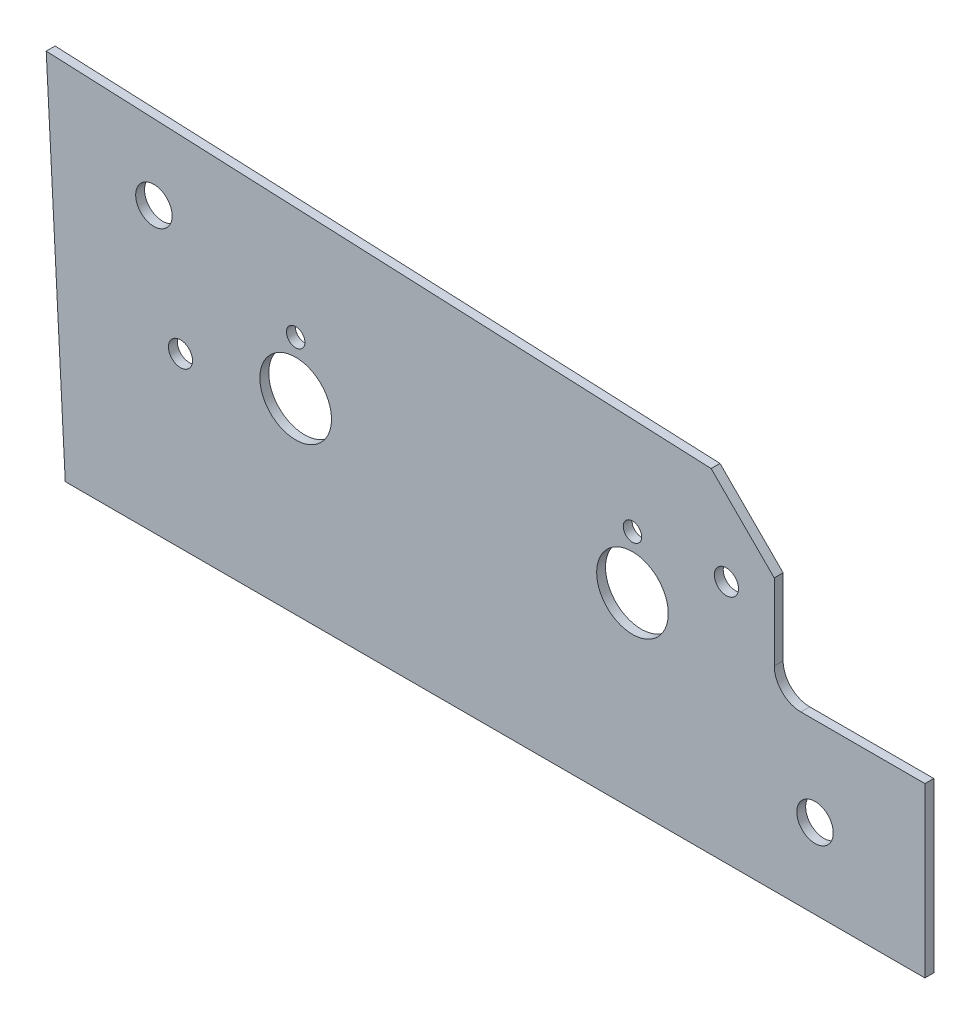
ISO-10303-21;
HEADER;
FILE_DESCRIPTION(('STEP AP214'),'2;1');
FILE_NAME('part.step','',(''),(''),'','','');
FILE_SCHEMA(('AUTOMOTIVE_DESIGN { 1 0 10303 214 1 1 1 1 }'));
ENDSEC;
DATA;
#1=APPLICATION_CONTEXT('core data for automotive mechanical design processes');
#2=APPLICATION_PROTOCOL_DEFINITION('international standard','automotive_design',2000,#1);
#3=PRODUCT_CONTEXT('',#1,'mechanical');
#4=PRODUCT('Part','Part','',(#3));
#5=PRODUCT_RELATED_PRODUCT_CATEGORY('part','',(#4));
#6=PRODUCT_DEFINITION_FORMATION('','',#4);
#7=PRODUCT_DEFINITION_CONTEXT('part definition',#1,'design');
#8=PRODUCT_DEFINITION('design','',#6,#7);
#9=PRODUCT_DEFINITION_SHAPE('','',#8);
#10=(LENGTH_UNIT() NAMED_UNIT(*) SI_UNIT(.MILLI.,.METRE.));
#11=(NAMED_UNIT(*) PLANE_ANGLE_UNIT() SI_UNIT($,.RADIAN.));
#12=(NAMED_UNIT(*) SI_UNIT($,.STERADIAN.) SOLID_ANGLE_UNIT());
#13=UNCERTAINTY_MEASURE_WITH_UNIT(LENGTH_MEASURE(1.E-05),#10,'distance_accuracy_value','');
#14=(GEOMETRIC_REPRESENTATION_CONTEXT(3) GLOBAL_UNCERTAINTY_ASSIGNED_CONTEXT((#13)) GLOBAL_UNIT_ASSIGNED_CONTEXT((#10,
#11,#12)) REPRESENTATION_CONTEXT('',''));
#15=CARTESIAN_POINT('',(0.,0.,0.));
#16=DIRECTION('',(0.,0.,1.));
#17=DIRECTION('',(1.,0.,0.));
#18=AXIS2_PLACEMENT_3D('',#15,#16,#17);
#19=CARTESIAN_POINT('',(-78.6992934003684,32.5437554814104,1.5875));
#20=DIRECTION('',(0.,0.,1.));
#21=DIRECTION('',(1.,0.,0.));
#22=AXIS2_PLACEMENT_3D('',#19,#20,#21);
#23=PLANE('',#22);
#24=CARTESIAN_POINT('',(-19.685,14.2875,1.5875));
#25=DIRECTION('',(0.,0.,-1.));
#26=DIRECTION('',(-1.,0.,0.));
#27=AXIS2_PLACEMENT_3D('',#24,#25,#26);
#28=CIRCLE('',#27,3.2639);
#29=CARTESIAN_POINT('',(-22.9489,14.2875,1.5875));
#30=VERTEX_POINT('',#29);
#31=EDGE_CURVE('E147',#30,#30,#28,.T.);
#32=ORIENTED_EDGE('',*,*,#31,.T.);
#33=EDGE_LOOP('',(#32));
#34=FACE_BOUND('',#33,.T.);
#35=CARTESIAN_POINT('',(-138.1125,50.8,1.5875));
#36=DIRECTION('',(0.,0.,-1.));
#37=DIRECTION('',(-1.,0.,0.));
#38=AXIS2_PLACEMENT_3D('',#35,#36,#37);
#39=CIRCLE('',#38,3.2639);
#40=CARTESIAN_POINT('',(-141.3764,50.8,1.5875));
#41=VERTEX_POINT('',#40);
#42=EDGE_CURVE('E206',#41,#41,#39,.T.);
#43=ORIENTED_EDGE('',*,*,#42,.T.);
#44=EDGE_LOOP('',(#43));
#45=FACE_BOUND('',#44,.T.);
#46=CARTESIAN_POINT('',(-35.56,43.688,1.5875));
#47=DIRECTION('',(0.,0.,-1.));
#48=DIRECTION('',(-1.,0.,0.));
#49=AXIS2_PLACEMENT_3D('',#46,#47,#48);
#50=CIRCLE('',#49,2.159);
#51=CARTESIAN_POINT('',(-37.719,43.688,1.5875));
#52=VERTEX_POINT('',#51);
#53=EDGE_CURVE('E209',#52,#52,#50,.T.);
#54=ORIENTED_EDGE('',*,*,#53,.T.);
#55=EDGE_LOOP('',(#54));
#56=FACE_BOUND('',#55,.T.);
#57=CARTESIAN_POINT('',(-133.35,30.1625,1.5875));
#58=DIRECTION('',(0.,0.,-1.));
#59=DIRECTION('',(-1.,0.,0.));
#60=AXIS2_PLACEMENT_3D('',#57,#58,#59);
#61=CIRCLE('',#60,2.15899999999999);
#62=CARTESIAN_POINT('',(-135.509,30.1625,1.5875));
#63=VERTEX_POINT('',#62);
#64=EDGE_CURVE('E212',#63,#63,#61,.T.);
#65=ORIENTED_EDGE('',*,*,#64,.T.);
#66=EDGE_LOOP('',(#65));
#67=FACE_BOUND('',#66,.T.);
#68=CARTESIAN_POINT('',(-52.3875,33.528,1.5875));
#69=DIRECTION('',(0.,0.,-1.));
#70=DIRECTION('',(-1.,0.,0.));
#71=AXIS2_PLACEMENT_3D('',#68,#69,#70);
#72=CIRCLE('',#71,6.4135);
#73=CARTESIAN_POINT('',(-58.801,33.528,1.5875));
#74=VERTEX_POINT('',#73);
#75=EDGE_CURVE('E215',#74,#74,#72,.T.);
#76=ORIENTED_EDGE('',*,*,#75,.T.);
#77=EDGE_LOOP('',(#76));
#78=FACE_BOUND('',#77,.T.);
#79=CARTESIAN_POINT('',(-112.7125,33.528,1.5875));
#80=DIRECTION('',(0.,0.,-1.));
#81=DIRECTION('',(-1.,0.,0.));
#82=AXIS2_PLACEMENT_3D('',#79,#80,#81);
#83=CIRCLE('',#82,6.4135);
#84=CARTESIAN_POINT('',(-119.126,33.528,1.5875));
#85=VERTEX_POINT('',#84);
#86=EDGE_CURVE('E218',#85,#85,#83,.T.);
#87=ORIENTED_EDGE('',*,*,#86,.T.);
#88=EDGE_LOOP('',(#87));
#89=FACE_BOUND('',#88,.T.);
#90=CARTESIAN_POINT('',(-52.3875,43.053,1.5875));
#91=DIRECTION('',(0.,0.,-1.));
#92=DIRECTION('',(-1.,0.,0.));
#93=AXIS2_PLACEMENT_3D('',#90,#91,#92);
#94=CIRCLE('',#93,1.651);
#95=CARTESIAN_POINT('',(-54.0385,43.053,1.5875));
#96=VERTEX_POINT('',#95);
#97=EDGE_CURVE('E221',#96,#96,#94,.T.);
#98=ORIENTED_EDGE('',*,*,#97,.T.);
#99=EDGE_LOOP('',(#98));
#100=FACE_BOUND('',#99,.T.);
#101=CARTESIAN_POINT('',(-112.7125,43.053,1.5875));
#102=DIRECTION('',(0.,0.,-1.));
#103=DIRECTION('',(-1.,0.,0.));
#104=AXIS2_PLACEMENT_3D('',#101,#102,#103);
#105=CIRCLE('',#104,1.65100000000001);
#106=CARTESIAN_POINT('',(-114.3635,43.053,1.5875));
#107=VERTEX_POINT('',#106);
#108=EDGE_CURVE('E172',#107,#107,#105,.T.);
#109=ORIENTED_EDGE('',*,*,#108,.T.);
#110=EDGE_LOOP('',(#109));
#111=FACE_BOUND('',#110,.T.);
#112=DIRECTION('',(0.,1.,0.));
#113=VECTOR('',#112,1.);
#114=CARTESIAN_POINT('',(-26.9875,30.1625,1.5875));
#115=LINE('',#114,#113);
#116=CARTESIAN_POINT('',(-26.9875,48.5775,1.5875));
#117=VERTEX_POINT('',#116);
#118=CARTESIAN_POINT('',(-26.9875,34.925,1.5875));
#119=VERTEX_POINT('',#118);
#120=EDGE_CURVE('E84',#117,#119,#115,.F.);
#121=ORIENTED_EDGE('',*,*,#120,.F.);
#122=DIRECTION('',(-0.707106781186547,0.707106781186548,0.));
#123=VECTOR('',#122,1.);
#124=CARTESIAN_POINT('',(-26.9875,48.5775,1.5875));
#125=LINE('',#124,#123);
#126=CARTESIAN_POINT('',(-38.2974340196943,59.8874340196943,1.5875));
#127=VERTEX_POINT('',#126);
#128=EDGE_CURVE('E96',#127,#117,#125,.F.);
#129=ORIENTED_EDGE('',*,*,#128,.F.);
#130=DIRECTION('',(-0.999048218543763,0.0436194569491033,0.));
#131=VECTOR('',#130,1.);
#132=CARTESIAN_POINT('',(-38.2974340196943,59.8874340196943,1.5875));
#133=LINE('',#132,#131);
#134=CARTESIAN_POINT('',(-157.398586800737,65.087510962821,1.5875));
#135=VERTEX_POINT('',#134);
#136=EDGE_CURVE('E152',#135,#127,#133,.F.);
#137=ORIENTED_EDGE('',*,*,#136,.F.);
#138=DIRECTION('',(0.0523358866883377,-0.998629538399774,0.));
#139=VECTOR('',#138,1.);
#140=CARTESIAN_POINT('',(-157.398586800737,65.0875109628208,1.5875));
#141=LINE('',#140,#139);
#142=CARTESIAN_POINT('',(-153.9875,1.07252384123794E-05,1.5875));
#143=VERTEX_POINT('',#142);
#144=EDGE_CURVE('E159',#143,#135,#141,.F.);
#145=ORIENTED_EDGE('',*,*,#144,.F.);
#146=DIRECTION('',(0.999999999999998,-6.96500587106396E-08,0.));
#147=VECTOR('',#146,1.);
#148=CARTESIAN_POINT('',(-153.9875,1.07252384157047E-05,1.5875));
#149=LINE('',#148,#147);
#150=CARTESIAN_POINT('',(0.,0.,1.5875));
#151=VERTEX_POINT('',#150);
#152=EDGE_CURVE('E142',#151,#143,#149,.F.);
#153=ORIENTED_EDGE('',*,*,#152,.F.);
#154=DIRECTION('',(0.,1.,0.));
#155=VECTOR('',#154,1.);
#156=CARTESIAN_POINT('',(0.,0.,1.5875));
#157=LINE('',#156,#155);
#158=CARTESIAN_POINT('',(0.,30.1625,1.5875));
#159=VERTEX_POINT('',#158);
#160=EDGE_CURVE('E132',#159,#151,#157,.F.);
#161=ORIENTED_EDGE('',*,*,#160,.F.);
#162=DIRECTION('',(1.,0.,0.));
#163=VECTOR('',#162,1.);
#164=CARTESIAN_POINT('',(0.,30.1625,1.5875));
#165=LINE('',#164,#163);
#166=CARTESIAN_POINT('',(-22.225,30.1625,1.5875));
#167=VERTEX_POINT('',#166);
#168=EDGE_CURVE('E79',#167,#159,#165,.T.);
#169=ORIENTED_EDGE('',*,*,#168,.F.);
#170=CARTESIAN_POINT('',(-22.225,34.925,1.5875));
#171=DIRECTION('',(0.,0.,1.));
#172=DIRECTION('',(1.,0.,0.));
#173=AXIS2_PLACEMENT_3D('',#170,#171,#172);
#174=CIRCLE('',#173,4.7625);
#175=EDGE_CURVE('E20',#167,#119,#174,.F.);
#176=ORIENTED_EDGE('',*,*,#175,.T.);
#177=EDGE_LOOP('',(#121,#129,#137,#145,#153,#161,#169,#176));
#178=FACE_BOUND('',#177,.T.);
#179=ADVANCED_FACE('F17',(#34,#45,#56,#67,#78,#89,#100,#111,#178),#23,.T.);
#180=CARTESIAN_POINT('',(-157.398586800737,65.0875109628208,0.));
#181=DIRECTION('',(-0.998629538399774,-0.0523358866883377,0.));
#182=DIRECTION('',(0.0523358866883377,-0.998629538399774,0.));
#183=AXIS2_PLACEMENT_3D('',#180,#181,#182);
#184=PLANE('',#183);
#185=ORIENTED_EDGE('',*,*,#144,.T.);
#186=DIRECTION('',(0.,0.,1.));
#187=VECTOR('',#186,1.);
#188=CARTESIAN_POINT('',(-157.398586800737,65.087510962821,0.));
#189=LINE('',#188,#187);
#190=CARTESIAN_POINT('',(-157.398586800737,65.0875109628209,0.));
#191=VERTEX_POINT('',#190);
#192=EDGE_CURVE('E115',#191,#135,#189,.T.);
#193=ORIENTED_EDGE('',*,*,#192,.F.);
#194=DIRECTION('',(0.0523358866883389,-0.998629538399774,0.));
#195=VECTOR('',#194,1.);
#196=CARTESIAN_POINT('',(-157.398586800737,65.0875109628208,0.));
#197=LINE('',#196,#195);
#198=CARTESIAN_POINT('',(-153.9875,1.07252384067411E-05,0.));
#199=VERTEX_POINT('',#198);
#200=EDGE_CURVE('E137',#191,#199,#197,.T.);
#201=ORIENTED_EDGE('',*,*,#200,.T.);
#202=DIRECTION('',(0.,0.,1.));
#203=VECTOR('',#202,1.);
#204=CARTESIAN_POINT('',(-153.9875,1.07252384157047E-05,0.));
#205=LINE('',#204,#203);
#206=EDGE_CURVE('E140',#143,#199,#205,.F.);
#207=ORIENTED_EDGE('',*,*,#206,.F.);
#208=EDGE_LOOP('',(#185,#193,#201,#207));
#209=FACE_BOUND('',#208,.T.);
#210=ADVANCED_FACE('F282',(#209),#184,.T.);
#211=CARTESIAN_POINT('',(-153.9875,1.07252384157047E-05,0.));
#212=DIRECTION('',(-6.96500587106396E-08,-0.999999999999998,0.));
#213=DIRECTION('',(0.999999999999998,-6.96500587106396E-08,0.));
#214=AXIS2_PLACEMENT_3D('',#211,#212,#213);
#215=PLANE('',#214);
#216=ORIENTED_EDGE('',*,*,#152,.T.);
#217=ORIENTED_EDGE('',*,*,#206,.T.);
#218=DIRECTION('',(0.999999999999998,-6.96500586909176E-08,0.));
#219=VECTOR('',#218,1.);
#220=CARTESIAN_POINT('',(-153.9875,1.07252384126677E-05,0.));
#221=LINE('',#220,#219);
#222=CARTESIAN_POINT('',(0.,0.,0.));
#223=VERTEX_POINT('',#222);
#224=EDGE_CURVE('E127',#199,#223,#221,.T.);
#225=ORIENTED_EDGE('',*,*,#224,.T.);
#226=DIRECTION('',(0.,0.,-1.));
#227=VECTOR('',#226,1.);
#228=CARTESIAN_POINT('',(0.,0.,0.));
#229=LINE('',#228,#227);
#230=EDGE_CURVE('E130',#151,#223,#229,.T.);
#231=ORIENTED_EDGE('',*,*,#230,.F.);
#232=EDGE_LOOP('',(#216,#217,#225,#231));
#233=FACE_BOUND('',#232,.T.);
#234=ADVANCED_FACE('F289',(#233),#215,.T.);
#235=CARTESIAN_POINT('',(0.,0.,0.));
#236=DIRECTION('',(1.,0.,0.));
#237=DIRECTION('',(0.,0.,-1.));
#238=AXIS2_PLACEMENT_3D('',#235,#236,#237);
#239=PLANE('',#238);
#240=ORIENTED_EDGE('',*,*,#160,.T.);
#241=ORIENTED_EDGE('',*,*,#230,.T.);
#242=DIRECTION('',(0.,1.,0.));
#243=VECTOR('',#242,1.);
#244=CARTESIAN_POINT('',(0.,32.5437554814104,0.));
#245=LINE('',#244,#243);
#246=CARTESIAN_POINT('',(0.,30.1625,0.));
#247=VERTEX_POINT('',#246);
#248=EDGE_CURVE('E123',#223,#247,#245,.T.);
#249=ORIENTED_EDGE('',*,*,#248,.T.);
#250=DIRECTION('',(0.,0.,1.));
#251=VECTOR('',#250,1.);
#252=CARTESIAN_POINT('',(0.,30.1625,0.));
#253=LINE('',#252,#251);
#254=EDGE_CURVE('E119',#159,#247,#253,.F.);
#255=ORIENTED_EDGE('',*,*,#254,.F.);
#256=EDGE_LOOP('',(#240,#241,#249,#255));
#257=FACE_BOUND('',#256,.T.);
#258=ADVANCED_FACE('F308',(#257),#239,.T.);
#259=CARTESIAN_POINT('',(0.,30.1625,0.));
#260=DIRECTION('',(0.,1.,0.));
#261=DIRECTION('',(0.,0.,1.));
#262=AXIS2_PLACEMENT_3D('',#259,#260,#261);
#263=PLANE('',#262);
#264=ORIENTED_EDGE('',*,*,#254,.T.);
#265=DIRECTION('',(1.,0.,0.));
#266=VECTOR('',#265,1.);
#267=CARTESIAN_POINT('',(-78.6992934003684,30.1625,0.));
#268=LINE('',#267,#266);
#269=CARTESIAN_POINT('',(-22.225,30.1625,0.));
#270=VERTEX_POINT('',#269);
#271=EDGE_CURVE('E126',#247,#270,#268,.F.);
#272=ORIENTED_EDGE('',*,*,#271,.T.);
#273=DIRECTION('',(0.,0.,1.));
#274=VECTOR('',#273,1.);
#275=CARTESIAN_POINT('',(-22.225,30.1625,0.));
#276=LINE('',#275,#274);
#277=EDGE_CURVE('E90',#270,#167,#276,.T.);
#278=ORIENTED_EDGE('',*,*,#277,.T.);
#279=ORIENTED_EDGE('',*,*,#168,.T.);
#280=EDGE_LOOP('',(#264,#272,#278,#279));
#281=FACE_BOUND('',#280,.T.);
#282=ADVANCED_FACE('F314',(#281),#263,.T.);
#283=CARTESIAN_POINT('',(-22.225,34.925,0.));
#284=DIRECTION('',(0.,0.,1.));
#285=DIRECTION('',(1.,0.,0.));
#286=AXIS2_PLACEMENT_3D('',#283,#284,#285);
#287=CYLINDRICAL_SURFACE('',#286,4.7625);
#288=DIRECTION('',(0.,0.,1.));
#289=VECTOR('',#288,1.);
#290=CARTESIAN_POINT('',(-26.9875,34.925,0.));
#291=LINE('',#290,#289);
#292=CARTESIAN_POINT('',(-26.9875,34.925,0.));
#293=VERTEX_POINT('',#292);
#294=EDGE_CURVE('E89',#119,#293,#291,.F.);
#295=ORIENTED_EDGE('',*,*,#294,.F.);
#296=ORIENTED_EDGE('',*,*,#175,.F.);
#297=ORIENTED_EDGE('',*,*,#277,.F.);
#298=CARTESIAN_POINT('',(-22.225,34.925,0.));
#299=DIRECTION('',(0.,0.,1.));
#300=DIRECTION('',(1.,0.,0.));
#301=AXIS2_PLACEMENT_3D('',#298,#299,#300);
#302=CIRCLE('',#301,4.7625);
#303=EDGE_CURVE('E101',#270,#293,#302,.F.);
#304=ORIENTED_EDGE('',*,*,#303,.T.);
#305=EDGE_LOOP('',(#295,#296,#297,#304));
#306=FACE_BOUND('',#305,.T.);
#307=ADVANCED_FACE('F99',(#306),#287,.F.);
#308=CARTESIAN_POINT('',(-26.9875,30.1625,0.));
#309=DIRECTION('',(1.,0.,0.));
#310=DIRECTION('',(0.,1.,0.));
#311=AXIS2_PLACEMENT_3D('',#308,#309,#310);
#312=PLANE('',#311);
#313=DIRECTION('',(0.,0.,1.));
#314=VECTOR('',#313,1.);
#315=CARTESIAN_POINT('',(-26.9875,48.5775,0.));
#316=LINE('',#315,#314);
#317=CARTESIAN_POINT('',(-26.9875,48.5775,0.));
#318=VERTEX_POINT('',#317);
#319=EDGE_CURVE('E95',#117,#318,#316,.F.);
#320=ORIENTED_EDGE('',*,*,#319,.F.);
#321=ORIENTED_EDGE('',*,*,#120,.T.);
#322=ORIENTED_EDGE('',*,*,#294,.T.);
#323=DIRECTION('',(0.,1.,0.));
#324=VECTOR('',#323,1.);
#325=CARTESIAN_POINT('',(-26.9875,32.5437554814104,0.));
#326=LINE('',#325,#324);
#327=EDGE_CURVE('E111',#293,#318,#326,.T.);
#328=ORIENTED_EDGE('',*,*,#327,.T.);
#329=EDGE_LOOP('',(#320,#321,#322,#328));
#330=FACE_BOUND('',#329,.T.);
#331=ADVANCED_FACE('F92',(#330),#312,.T.);
#332=CARTESIAN_POINT('',(-26.9875,48.5775,0.));
#333=DIRECTION('',(0.707106781186548,0.707106781186547,0.));
#334=DIRECTION('',(-0.707106781186547,0.707106781186548,0.));
#335=AXIS2_PLACEMENT_3D('',#332,#333,#334);
#336=PLANE('',#335);
#337=ORIENTED_EDGE('',*,*,#128,.T.);
#338=ORIENTED_EDGE('',*,*,#319,.T.);
#339=DIRECTION('',(-0.707106781186548,0.707106781186547,0.));
#340=VECTOR('',#339,1.);
#341=CARTESIAN_POINT('',(-26.9875,48.5775,0.));
#342=LINE('',#341,#340);
#343=CARTESIAN_POINT('',(-38.2974340196943,59.8874340196943,0.));
#344=VERTEX_POINT('',#343);
#345=EDGE_CURVE('E107',#318,#344,#342,.T.);
#346=ORIENTED_EDGE('',*,*,#345,.T.);
#347=DIRECTION('',(0.,0.,1.));
#348=VECTOR('',#347,1.);
#349=CARTESIAN_POINT('',(-38.2974340196943,59.8874340196943,0.));
#350=LINE('',#349,#348);
#351=EDGE_CURVE('E35',#127,#344,#350,.F.);
#352=ORIENTED_EDGE('',*,*,#351,.F.);
#353=EDGE_LOOP('',(#337,#338,#346,#352));
#354=FACE_BOUND('',#353,.T.);
#355=ADVANCED_FACE('F241',(#354),#336,.T.);
#356=CARTESIAN_POINT('',(-38.2974340196943,59.8874340196943,0.));
#357=DIRECTION('',(0.0436194569491033,0.999048218543763,0.));
#358=DIRECTION('',(-0.999048218543763,0.0436194569491033,0.));
#359=AXIS2_PLACEMENT_3D('',#356,#357,#358);
#360=PLANE('',#359);
#361=ORIENTED_EDGE('',*,*,#136,.T.);
#362=ORIENTED_EDGE('',*,*,#351,.T.);
#363=DIRECTION('',(-0.999048218543763,0.0436194569491018,0.));
#364=VECTOR('',#363,1.);
#365=CARTESIAN_POINT('',(-38.2974340196943,59.8874340196943,0.));
#366=LINE('',#365,#364);
#367=EDGE_CURVE('E110',#344,#191,#366,.T.);
#368=ORIENTED_EDGE('',*,*,#367,.T.);
#369=ORIENTED_EDGE('',*,*,#192,.T.);
#370=EDGE_LOOP('',(#361,#362,#368,#369));
#371=FACE_BOUND('',#370,.T.);
#372=ADVANCED_FACE('F230',(#371),#360,.T.);
#373=CARTESIAN_POINT('',(-112.7125,43.053,1.5875));
#374=DIRECTION('',(0.,0.,-1.));
#375=DIRECTION('',(-1.,0.,0.));
#376=AXIS2_PLACEMENT_3D('',#373,#374,#375);
#377=CYLINDRICAL_SURFACE('',#376,1.65100000000001);
#378=CARTESIAN_POINT('',(-112.7125,43.053,0.));
#379=DIRECTION('',(0.,0.,-1.));
#380=DIRECTION('',(-1.,0.,0.));
#381=AXIS2_PLACEMENT_3D('',#378,#379,#380);
#382=CIRCLE('',#381,1.65100000000001);
#383=CARTESIAN_POINT('',(-114.3635,43.053,0.));
#384=VERTEX_POINT('',#383);
#385=EDGE_CURVE('E156',#384,#384,#382,.T.);
#386=ORIENTED_EDGE('',*,*,#385,.T.);
#387=EDGE_LOOP('',(#386));
#388=FACE_BOUND('',#387,.T.);
#389=ORIENTED_EDGE('',*,*,#108,.F.);
#390=EDGE_LOOP('',(#389));
#391=FACE_BOUND('',#390,.T.);
#392=ADVANCED_FACE('F227',(#388,#391),#377,.F.);
#393=CARTESIAN_POINT('',(-52.3875,43.053,1.5875));
#394=DIRECTION('',(0.,0.,-1.));
#395=DIRECTION('',(-1.,0.,0.));
#396=AXIS2_PLACEMENT_3D('',#393,#394,#395);
#397=CYLINDRICAL_SURFACE('',#396,1.651);
#398=CARTESIAN_POINT('',(-52.3875,43.053,0.));
#399=DIRECTION('',(0.,0.,-1.));
#400=DIRECTION('',(-1.,0.,0.));
#401=AXIS2_PLACEMENT_3D('',#398,#399,#400);
#402=CIRCLE('',#401,1.651);
#403=CARTESIAN_POINT('',(-54.0385,43.053,0.));
#404=VERTEX_POINT('',#403);
#405=EDGE_CURVE('E198',#404,#404,#402,.T.);
#406=ORIENTED_EDGE('',*,*,#405,.T.);
#407=EDGE_LOOP('',(#406));
#408=FACE_BOUND('',#407,.T.);
#409=ORIENTED_EDGE('',*,*,#97,.F.);
#410=EDGE_LOOP('',(#409));
#411=FACE_BOUND('',#410,.T.);
#412=ADVANCED_FACE('F229',(#408,#411),#397,.F.);
#413=CARTESIAN_POINT('',(-112.7125,33.528,1.5875));
#414=DIRECTION('',(0.,0.,-1.));
#415=DIRECTION('',(-1.,0.,0.));
#416=AXIS2_PLACEMENT_3D('',#413,#414,#415);
#417=CYLINDRICAL_SURFACE('',#416,6.4135);
#418=CARTESIAN_POINT('',(-112.7125,33.528,0.));
#419=DIRECTION('',(0.,0.,-1.));
#420=DIRECTION('',(-1.,0.,0.));
#421=AXIS2_PLACEMENT_3D('',#418,#419,#420);
#422=CIRCLE('',#421,6.4135);
#423=CARTESIAN_POINT('',(-119.126,33.528,0.));
#424=VERTEX_POINT('',#423);
#425=EDGE_CURVE('E195',#424,#424,#422,.T.);
#426=ORIENTED_EDGE('',*,*,#425,.T.);
#427=EDGE_LOOP('',(#426));
#428=FACE_BOUND('',#427,.T.);
#429=ORIENTED_EDGE('',*,*,#86,.F.);
#430=EDGE_LOOP('',(#429));
#431=FACE_BOUND('',#430,.T.);
#432=ADVANCED_FACE('F238',(#428,#431),#417,.F.);
#433=CARTESIAN_POINT('',(-52.3875,33.528,1.5875));
#434=DIRECTION('',(0.,0.,-1.));
#435=DIRECTION('',(-1.,0.,0.));
#436=AXIS2_PLACEMENT_3D('',#433,#434,#435);
#437=CYLINDRICAL_SURFACE('',#436,6.4135);
#438=CARTESIAN_POINT('',(-52.3875,33.528,0.));
#439=DIRECTION('',(0.,0.,-1.));
#440=DIRECTION('',(-1.,0.,0.));
#441=AXIS2_PLACEMENT_3D('',#438,#439,#440);
#442=CIRCLE('',#441,6.4135);
#443=CARTESIAN_POINT('',(-58.801,33.528,0.));
#444=VERTEX_POINT('',#443);
#445=EDGE_CURVE('E192',#444,#444,#442,.T.);
#446=ORIENTED_EDGE('',*,*,#445,.T.);
#447=EDGE_LOOP('',(#446));
#448=FACE_BOUND('',#447,.T.);
#449=ORIENTED_EDGE('',*,*,#75,.F.);
#450=EDGE_LOOP('',(#449));
#451=FACE_BOUND('',#450,.T.);
#452=ADVANCED_FACE('F267',(#448,#451),#437,.F.);
#453=CARTESIAN_POINT('',(-133.35,30.1625,7.4295));
#454=DIRECTION('',(0.,0.,-1.));
#455=DIRECTION('',(-1.,0.,0.));
#456=AXIS2_PLACEMENT_3D('',#453,#454,#455);
#457=CYLINDRICAL_SURFACE('',#456,2.15899999999999);
#458=CARTESIAN_POINT('',(-133.35,30.1625,0.));
#459=DIRECTION('',(0.,0.,-1.));
#460=DIRECTION('',(-1.,0.,0.));
#461=AXIS2_PLACEMENT_3D('',#458,#459,#460);
#462=CIRCLE('',#461,2.15899999999999);
#463=CARTESIAN_POINT('',(-135.509,30.1625,0.));
#464=VERTEX_POINT('',#463);
#465=EDGE_CURVE('E189',#464,#464,#462,.T.);
#466=ORIENTED_EDGE('',*,*,#465,.T.);
#467=EDGE_LOOP('',(#466));
#468=FACE_BOUND('',#467,.T.);
#469=ORIENTED_EDGE('',*,*,#64,.F.);
#470=EDGE_LOOP('',(#469));
#471=FACE_BOUND('',#470,.T.);
#472=ADVANCED_FACE('F263',(#468,#471),#457,.F.);
#473=CARTESIAN_POINT('',(-35.56,43.688,7.4295));
#474=DIRECTION('',(0.,0.,-1.));
#475=DIRECTION('',(-1.,0.,0.));
#476=AXIS2_PLACEMENT_3D('',#473,#474,#475);
#477=CYLINDRICAL_SURFACE('',#476,2.159);
#478=CARTESIAN_POINT('',(-35.56,43.688,0.));
#479=DIRECTION('',(0.,0.,-1.));
#480=DIRECTION('',(-1.,0.,0.));
#481=AXIS2_PLACEMENT_3D('',#478,#479,#480);
#482=CIRCLE('',#481,2.159);
#483=CARTESIAN_POINT('',(-37.719,43.688,0.));
#484=VERTEX_POINT('',#483);
#485=EDGE_CURVE('E186',#484,#484,#482,.T.);
#486=ORIENTED_EDGE('',*,*,#485,.T.);
#487=EDGE_LOOP('',(#486));
#488=FACE_BOUND('',#487,.T.);
#489=ORIENTED_EDGE('',*,*,#53,.F.);
#490=EDGE_LOOP('',(#489));
#491=FACE_BOUND('',#490,.T.);
#492=ADVANCED_FACE('F259',(#488,#491),#477,.F.);
#493=CARTESIAN_POINT('',(-138.1125,50.8,1.5875));
#494=DIRECTION('',(0.,0.,-1.));
#495=DIRECTION('',(-1.,0.,0.));
#496=AXIS2_PLACEMENT_3D('',#493,#494,#495);
#497=CYLINDRICAL_SURFACE('',#496,3.2639);
#498=CARTESIAN_POINT('',(-138.1125,50.8,0.));
#499=DIRECTION('',(0.,0.,-1.));
#500=DIRECTION('',(-1.,0.,0.));
#501=AXIS2_PLACEMENT_3D('',#498,#499,#500);
#502=CIRCLE('',#501,3.2639);
#503=CARTESIAN_POINT('',(-141.3764,50.8,0.));
#504=VERTEX_POINT('',#503);
#505=EDGE_CURVE('E26',#504,#504,#502,.T.);
#506=ORIENTED_EDGE('',*,*,#505,.T.);
#507=EDGE_LOOP('',(#506));
#508=FACE_BOUND('',#507,.T.);
#509=ORIENTED_EDGE('',*,*,#42,.F.);
#510=EDGE_LOOP('',(#509));
#511=FACE_BOUND('',#510,.T.);
#512=ADVANCED_FACE('F251',(#508,#511),#497,.F.);
#513=CARTESIAN_POINT('',(-19.685,14.2875,1.5875));
#514=DIRECTION('',(0.,0.,-1.));
#515=DIRECTION('',(-1.,0.,0.));
#516=AXIS2_PLACEMENT_3D('',#513,#514,#515);
#517=CYLINDRICAL_SURFACE('',#516,3.2639);
#518=CARTESIAN_POINT('',(-19.685,14.2875,0.));
#519=DIRECTION('',(0.,0.,-1.));
#520=DIRECTION('',(-1.,0.,0.));
#521=AXIS2_PLACEMENT_3D('',#518,#519,#520);
#522=CIRCLE('',#521,3.2639);
#523=CARTESIAN_POINT('',(-22.9489,14.2875,0.));
#524=VERTEX_POINT('',#523);
#525=EDGE_CURVE('E11',#524,#524,#522,.T.);
#526=ORIENTED_EDGE('',*,*,#525,.T.);
#527=EDGE_LOOP('',(#526));
#528=FACE_BOUND('',#527,.T.);
#529=ORIENTED_EDGE('',*,*,#31,.F.);
#530=EDGE_LOOP('',(#529));
#531=FACE_BOUND('',#530,.T.);
#532=ADVANCED_FACE('F245',(#528,#531),#517,.F.);
#533=CARTESIAN_POINT('',(-78.6992934003684,32.5437554814104,0.));
#534=DIRECTION('',(0.,0.,1.));
#535=DIRECTION('',(1.,0.,0.));
#536=AXIS2_PLACEMENT_3D('',#533,#534,#535);
#537=PLANE('',#536);
#538=ORIENTED_EDGE('',*,*,#525,.F.);
#539=EDGE_LOOP('',(#538));
#540=FACE_BOUND('',#539,.T.);
#541=ORIENTED_EDGE('',*,*,#505,.F.);
#542=EDGE_LOOP('',(#541));
#543=FACE_BOUND('',#542,.T.);
#544=ORIENTED_EDGE('',*,*,#485,.F.);
#545=EDGE_LOOP('',(#544));
#546=FACE_BOUND('',#545,.T.);
#547=ORIENTED_EDGE('',*,*,#465,.F.);
#548=EDGE_LOOP('',(#547));
#549=FACE_BOUND('',#548,.T.);
#550=ORIENTED_EDGE('',*,*,#445,.F.);
#551=EDGE_LOOP('',(#550));
#552=FACE_BOUND('',#551,.T.);
#553=ORIENTED_EDGE('',*,*,#425,.F.);
#554=EDGE_LOOP('',(#553));
#555=FACE_BOUND('',#554,.T.);
#556=ORIENTED_EDGE('',*,*,#405,.F.);
#557=EDGE_LOOP('',(#556));
#558=FACE_BOUND('',#557,.T.);
#559=ORIENTED_EDGE('',*,*,#385,.F.);
#560=EDGE_LOOP('',(#559));
#561=FACE_BOUND('',#560,.T.);
#562=ORIENTED_EDGE('',*,*,#345,.F.);
#563=ORIENTED_EDGE('',*,*,#327,.F.);
#564=ORIENTED_EDGE('',*,*,#303,.F.);
#565=ORIENTED_EDGE('',*,*,#271,.F.);
#566=ORIENTED_EDGE('',*,*,#248,.F.);
#567=ORIENTED_EDGE('',*,*,#224,.F.);
#568=ORIENTED_EDGE('',*,*,#200,.F.);
#569=ORIENTED_EDGE('',*,*,#367,.F.);
#570=EDGE_LOOP('',(#562,#563,#564,#565,#566,#567,#568,#569));
#571=FACE_BOUND('',#570,.T.);
#572=ADVANCED_FACE('F243',(#540,#543,#546,#549,#552,#555,#558,#561,#571),#537,.F.);
#573=CLOSED_SHELL('',(#179,#210,#234,#258,#282,#307,#331,#355,#372,#392,#412,#432,#452,#472,
#492,#512,#532,#572));
#574=MANIFOLD_SOLID_BREP('B1',#573);
#575=ADVANCED_BREP_SHAPE_REPRESENTATION('',(#18,#574),#14);
#576=SHAPE_DEFINITION_REPRESENTATION(#9,#575);
ENDSEC;
END-ISO-10303-21;
